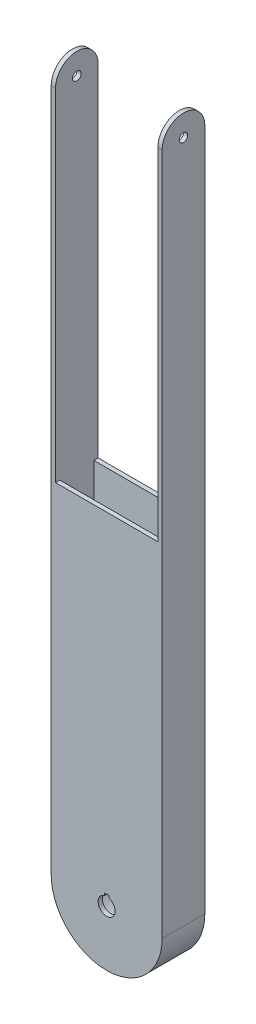
ISO-10303-21;
HEADER;
FILE_DESCRIPTION(('STEP AP214'),'2;1');
FILE_NAME('part.step','',(''),(''),'','','');
FILE_SCHEMA(('AUTOMOTIVE_DESIGN { 1 0 10303 214 1 1 1 1 }'));
ENDSEC;
DATA;
#1=APPLICATION_CONTEXT('core data for automotive mechanical design processes');
#2=APPLICATION_PROTOCOL_DEFINITION('international standard','automotive_design',2000,#1);
#3=PRODUCT_CONTEXT('',#1,'mechanical');
#4=PRODUCT('Part','Part','',(#3));
#5=PRODUCT_RELATED_PRODUCT_CATEGORY('part','',(#4));
#6=PRODUCT_DEFINITION_FORMATION('','',#4);
#7=PRODUCT_DEFINITION_CONTEXT('part definition',#1,'design');
#8=PRODUCT_DEFINITION('design','',#6,#7);
#9=PRODUCT_DEFINITION_SHAPE('','',#8);
#10=(LENGTH_UNIT() NAMED_UNIT(*) SI_UNIT(.MILLI.,.METRE.));
#11=(NAMED_UNIT(*) PLANE_ANGLE_UNIT() SI_UNIT($,.RADIAN.));
#12=(NAMED_UNIT(*) SI_UNIT($,.STERADIAN.) SOLID_ANGLE_UNIT());
#13=UNCERTAINTY_MEASURE_WITH_UNIT(LENGTH_MEASURE(1.E-05),#10,'distance_accuracy_value','');
#14=(GEOMETRIC_REPRESENTATION_CONTEXT(3) GLOBAL_UNCERTAINTY_ASSIGNED_CONTEXT((#13)) GLOBAL_UNIT_ASSIGNED_CONTEXT((#10,
#11,#12)) REPRESENTATION_CONTEXT('',''));
#15=CARTESIAN_POINT('',(0.,0.,0.));
#16=DIRECTION('',(0.,0.,1.));
#17=DIRECTION('',(1.,0.,0.));
#18=AXIS2_PLACEMENT_3D('',#15,#16,#17);
#19=CARTESIAN_POINT('',(-18.3612433862434,508.,0.));
#20=DIRECTION('',(1.,0.,0.));
#21=DIRECTION('',(0.,0.,-1.));
#22=AXIS2_PLACEMENT_3D('',#19,#20,#21);
#23=PLANE('',#22);
#24=CARTESIAN_POINT('',(-18.3612433862434,508.,-0.671957671957671));
#25=DIRECTION('',(-1.,0.,0.));
#26=DIRECTION('',(0.,0.,1.));
#27=AXIS2_PLACEMENT_3D('',#24,#25,#26);
#28=CIRCLE('',#27,3.175);
#29=CARTESIAN_POINT('',(-18.3612433862434,508.,2.50304232804233));
#30=VERTEX_POINT('',#29);
#31=EDGE_CURVE('E329',#30,#30,#28,.T.);
#32=ORIENTED_EDGE('',*,*,#31,.F.);
#33=EDGE_LOOP('',(#32));
#34=FACE_BOUND('',#33,.T.);
#35=DIRECTION('',(0.,0.,1.));
#36=VECTOR('',#35,1.);
#37=CARTESIAN_POINT('',(-18.3612433862434,0.,0.));
#38=LINE('',#37,#36);
#39=CARTESIAN_POINT('',(-18.3612433862434,0.,-16.5469576719577));
#40=VERTEX_POINT('',#39);
#41=CARTESIAN_POINT('',(-18.3612433862434,0.,15.2030423280423));
#42=VERTEX_POINT('',#41);
#43=EDGE_CURVE('E454',#40,#42,#38,.T.);
#44=ORIENTED_EDGE('',*,*,#43,.T.);
#45=DIRECTION('',(0.,-1.,0.));
#46=VECTOR('',#45,1.);
#47=CARTESIAN_POINT('',(-18.3612433862434,508.,15.2030423280423));
#48=LINE('',#47,#46);
#49=CARTESIAN_POINT('',(-18.3612433862434,508.,15.2030423280423));
#50=VERTEX_POINT('',#49);
#51=EDGE_CURVE('E576',#50,#42,#48,.T.);
#52=ORIENTED_EDGE('',*,*,#51,.F.);
#53=CARTESIAN_POINT('',(-18.3612433862434,508.,-0.671957671957671));
#54=DIRECTION('',(-1.,0.,0.));
#55=DIRECTION('',(0.,0.,1.));
#56=AXIS2_PLACEMENT_3D('',#53,#54,#55);
#57=CIRCLE('',#56,15.875);
#58=CARTESIAN_POINT('',(-18.3612433862434,508.,-16.5469576719577));
#59=VERTEX_POINT('',#58);
#60=EDGE_CURVE('E359',#50,#59,#57,.T.);
#61=ORIENTED_EDGE('',*,*,#60,.T.);
#62=DIRECTION('',(0.,-1.,0.));
#63=VECTOR('',#62,1.);
#64=CARTESIAN_POINT('',(-18.3612433862434,508.,-16.5469576719577));
#65=LINE('',#64,#63);
#66=EDGE_CURVE('E374',#59,#40,#65,.T.);
#67=ORIENTED_EDGE('',*,*,#66,.T.);
#68=EDGE_LOOP('',(#44,#52,#61,#67));
#69=FACE_BOUND('',#68,.T.);
#70=ADVANCED_FACE('F73',(#34,#69),#23,.F.);
#71=CARTESIAN_POINT('',(0.,508.,15.2030423280423));
#72=DIRECTION('',(0.,0.,-1.));
#73=DIRECTION('',(-1.,0.,0.));
#74=AXIS2_PLACEMENT_3D('',#71,#72,#73);
#75=PLANE('',#74);
#76=DIRECTION('',(1.,0.,0.));
#77=VECTOR('',#76,1.);
#78=CARTESIAN_POINT('',(25.5161774709475,508.,15.2030423280423));
#79=LINE('',#78,#77);
#80=CARTESIAN_POINT('',(61.0137566137566,508.,15.2030423280423));
#81=VERTEX_POINT('',#80);
#82=CARTESIAN_POINT('',(64.1887566137566,508.,15.2030423280423));
#83=VERTEX_POINT('',#82);
#84=EDGE_CURVE('E355',#81,#83,#79,.T.);
#85=ORIENTED_EDGE('',*,*,#84,.F.);
#86=DIRECTION('',(0.,1.,0.));
#87=VECTOR('',#86,1.);
#88=CARTESIAN_POINT('',(61.0137566137566,508.,15.2030423280423));
#89=LINE('',#88,#87);
#90=CARTESIAN_POINT('',(61.0137566137566,254.,15.2030423280423));
#91=VERTEX_POINT('',#90);
#92=EDGE_CURVE('E325',#91,#81,#89,.T.);
#93=ORIENTED_EDGE('',*,*,#92,.F.);
#94=DIRECTION('',(1.,0.,0.));
#95=VECTOR('',#94,1.);
#96=CARTESIAN_POINT('',(-15.1862433862434,254.,15.2030423280423));
#97=LINE('',#96,#95);
#98=CARTESIAN_POINT('',(-15.1862433862434,254.,15.2030423280423));
#99=VERTEX_POINT('',#98);
#100=EDGE_CURVE('E321',#99,#91,#97,.T.);
#101=ORIENTED_EDGE('',*,*,#100,.F.);
#102=DIRECTION('',(0.,-1.,0.));
#103=VECTOR('',#102,1.);
#104=CARTESIAN_POINT('',(-15.1862433862434,508.,15.2030423280423));
#105=LINE('',#104,#103);
#106=CARTESIAN_POINT('',(-15.1862433862434,508.,15.2030423280423));
#107=VERTEX_POINT('',#106);
#108=EDGE_CURVE('E314',#107,#99,#105,.T.);
#109=ORIENTED_EDGE('',*,*,#108,.F.);
#110=DIRECTION('',(1.,0.,0.));
#111=VECTOR('',#110,1.);
#112=CARTESIAN_POINT('',(0.,508.,15.2030423280423));
#113=LINE('',#112,#111);
#114=EDGE_CURVE('E444',#50,#107,#113,.T.);
#115=ORIENTED_EDGE('',*,*,#114,.F.);
#116=ORIENTED_EDGE('',*,*,#51,.T.);
#117=CARTESIAN_POINT('',(22.9137566137566,0.,15.2030423280423));
#118=DIRECTION('',(0.,0.,-1.));
#119=DIRECTION('',(-1.,0.,0.));
#120=AXIS2_PLACEMENT_3D('',#117,#118,#119);
#121=CIRCLE('',#120,41.275);
#122=CARTESIAN_POINT('',(64.1887566137566,0.,15.2030423280423));
#123=VERTEX_POINT('',#122);
#124=EDGE_CURVE('E473',#42,#123,#121,.F.);
#125=ORIENTED_EDGE('',*,*,#124,.T.);
#126=DIRECTION('',(0.,-1.,0.));
#127=VECTOR('',#126,1.);
#128=CARTESIAN_POINT('',(64.1887566137566,508.,15.2030423280423));
#129=LINE('',#128,#127);
#130=EDGE_CURVE('E388',#83,#123,#129,.T.);
#131=ORIENTED_EDGE('',*,*,#130,.F.);
#132=EDGE_LOOP('',(#85,#93,#101,#109,#115,#116,#125,#131));
#133=FACE_BOUND('',#132,.T.);
#134=DIRECTION('',(-1.,0.,0.));
#135=VECTOR('',#134,1.);
#136=CARTESIAN_POINT('',(21.3262566137566,7.9375,15.2030423280423));
#137=LINE('',#136,#135);
#138=CARTESIAN_POINT('',(24.5012566137566,7.9375,15.2030423280423));
#139=VERTEX_POINT('',#138);
#140=CARTESIAN_POINT('',(21.3262566137566,7.9375,15.2030423280423));
#141=VERTEX_POINT('',#140);
#142=EDGE_CURVE('E438',#139,#141,#137,.T.);
#143=ORIENTED_EDGE('',*,*,#142,.F.);
#144=DIRECTION('',(0.,1.,0.));
#145=VECTOR('',#144,1.);
#146=CARTESIAN_POINT('',(24.5012566137566,0.,15.2030423280423));
#147=LINE('',#146,#145);
#148=CARTESIAN_POINT('',(24.5012566137566,6.14836106210428,15.2030423280423));
#149=VERTEX_POINT('',#148);
#150=EDGE_CURVE('E433',#149,#139,#147,.T.);
#151=ORIENTED_EDGE('',*,*,#150,.F.);
#152=CARTESIAN_POINT('',(22.9137566137566,0.,15.2030423280423));
#153=DIRECTION('',(0.,0.,-1.));
#154=DIRECTION('',(-1.,0.,0.));
#155=AXIS2_PLACEMENT_3D('',#152,#153,#154);
#156=CIRCLE('',#155,6.35);
#157=CARTESIAN_POINT('',(21.3262566137566,6.14836106210428,15.2030423280423));
#158=VERTEX_POINT('',#157);
#159=EDGE_CURVE('E608',#158,#149,#156,.F.);
#160=ORIENTED_EDGE('',*,*,#159,.F.);
#161=DIRECTION('',(0.,-1.,0.));
#162=VECTOR('',#161,1.);
#163=CARTESIAN_POINT('',(21.3262566137566,0.,15.2030423280423));
#164=LINE('',#163,#162);
#165=EDGE_CURVE('E413',#141,#158,#164,.T.);
#166=ORIENTED_EDGE('',*,*,#165,.F.);
#167=EDGE_LOOP('',(#143,#151,#160,#166));
#168=FACE_BOUND('',#167,.T.);
#169=ADVANCED_FACE('F561',(#133,#168),#75,.F.);
#170=CARTESIAN_POINT('',(64.1887566137566,508.,0.));
#171=DIRECTION('',(-1.,0.,0.));
#172=DIRECTION('',(0.,0.,1.));
#173=AXIS2_PLACEMENT_3D('',#170,#171,#172);
#174=PLANE('',#173);
#175=CARTESIAN_POINT('',(64.1887566137566,508.,-0.671957671957671));
#176=DIRECTION('',(-1.,0.,0.));
#177=DIRECTION('',(0.,0.,1.));
#178=AXIS2_PLACEMENT_3D('',#175,#176,#177);
#179=CIRCLE('',#178,3.175);
#180=CARTESIAN_POINT('',(64.1887566137566,508.,2.50304232804233));
#181=VERTEX_POINT('',#180);
#182=EDGE_CURVE('E334',#181,#181,#179,.F.);
#183=ORIENTED_EDGE('',*,*,#182,.F.);
#184=EDGE_LOOP('',(#183));
#185=FACE_BOUND('',#184,.T.);
#186=DIRECTION('',(0.,0.,-1.));
#187=VECTOR('',#186,1.);
#188=CARTESIAN_POINT('',(64.1887566137566,0.,0.));
#189=LINE('',#188,#187);
#190=CARTESIAN_POINT('',(64.1887566137566,0.,-16.5469576719577));
#191=VERTEX_POINT('',#190);
#192=EDGE_CURVE('E381',#123,#191,#189,.T.);
#193=ORIENTED_EDGE('',*,*,#192,.T.);
#194=DIRECTION('',(0.,-1.,0.));
#195=VECTOR('',#194,1.);
#196=CARTESIAN_POINT('',(64.1887566137566,508.,-16.5469576719577));
#197=LINE('',#196,#195);
#198=CARTESIAN_POINT('',(64.1887566137566,508.,-16.5469576719577));
#199=VERTEX_POINT('',#198);
#200=EDGE_CURVE('E379',#199,#191,#197,.T.);
#201=ORIENTED_EDGE('',*,*,#200,.F.);
#202=CARTESIAN_POINT('',(64.1887566137566,508.,-0.671957671957671));
#203=DIRECTION('',(1.,0.,0.));
#204=DIRECTION('',(0.,0.,-1.));
#205=AXIS2_PLACEMENT_3D('',#202,#203,#204);
#206=CIRCLE('',#205,15.875);
#207=EDGE_CURVE('E345',#199,#83,#206,.T.);
#208=ORIENTED_EDGE('',*,*,#207,.T.);
#209=ORIENTED_EDGE('',*,*,#130,.T.);
#210=EDGE_LOOP('',(#193,#201,#208,#209));
#211=FACE_BOUND('',#210,.T.);
#212=ADVANCED_FACE('F558',(#185,#211),#174,.F.);
#213=CARTESIAN_POINT('',(0.,508.,-16.5469576719577));
#214=DIRECTION('',(0.,0.,1.));
#215=DIRECTION('',(1.,0.,0.));
#216=AXIS2_PLACEMENT_3D('',#213,#214,#215);
#217=PLANE('',#216);
#218=CARTESIAN_POINT('',(22.9137566137566,0.,-16.5469576719577));
#219=DIRECTION('',(0.,0.,-1.));
#220=DIRECTION('',(-1.,0.,0.));
#221=AXIS2_PLACEMENT_3D('',#218,#219,#220);
#222=CIRCLE('',#221,6.35);
#223=CARTESIAN_POINT('',(24.5012566137566,6.14836106210428,-16.5469576719577));
#224=VERTEX_POINT('',#223);
#225=CARTESIAN_POINT('',(21.3262566137566,6.14836106210428,-16.5469576719577));
#226=VERTEX_POINT('',#225);
#227=EDGE_CURVE('E532',#224,#226,#222,.T.);
#228=ORIENTED_EDGE('',*,*,#227,.F.);
#229=DIRECTION('',(0.,-1.,0.));
#230=VECTOR('',#229,1.);
#231=CARTESIAN_POINT('',(24.5012566137566,0.,-16.5469576719577));
#232=LINE('',#231,#230);
#233=CARTESIAN_POINT('',(24.5012566137566,7.9375,-16.5469576719577));
#234=VERTEX_POINT('',#233);
#235=EDGE_CURVE('E428',#234,#224,#232,.T.);
#236=ORIENTED_EDGE('',*,*,#235,.F.);
#237=DIRECTION('',(1.,0.,0.));
#238=VECTOR('',#237,1.);
#239=CARTESIAN_POINT('',(21.3262566137566,7.9375,-16.5469576719577));
#240=LINE('',#239,#238);
#241=CARTESIAN_POINT('',(21.3262566137566,7.9375,-16.5469576719577));
#242=VERTEX_POINT('',#241);
#243=EDGE_CURVE('E398',#242,#234,#240,.T.);
#244=ORIENTED_EDGE('',*,*,#243,.F.);
#245=DIRECTION('',(0.,1.,0.));
#246=VECTOR('',#245,1.);
#247=CARTESIAN_POINT('',(21.3262566137566,0.,-16.5469576719577));
#248=LINE('',#247,#246);
#249=EDGE_CURVE('E405',#226,#242,#248,.T.);
#250=ORIENTED_EDGE('',*,*,#249,.F.);
#251=EDGE_LOOP('',(#228,#236,#244,#250));
#252=FACE_BOUND('',#251,.T.);
#253=DIRECTION('',(-1.,0.,0.));
#254=VECTOR('',#253,1.);
#255=CARTESIAN_POINT('',(-15.1862433862434,254.,-16.5469576719577));
#256=LINE('',#255,#254);
#257=CARTESIAN_POINT('',(61.0137566137566,254.,-16.5469576719577));
#258=VERTEX_POINT('',#257);
#259=CARTESIAN_POINT('',(-15.1862433862434,254.,-16.5469576719577));
#260=VERTEX_POINT('',#259);
#261=EDGE_CURVE('E270',#258,#260,#256,.T.);
#262=ORIENTED_EDGE('',*,*,#261,.F.);
#263=DIRECTION('',(0.,-1.,0.));
#264=VECTOR('',#263,1.);
#265=CARTESIAN_POINT('',(61.0137566137566,508.,-16.5469576719577));
#266=LINE('',#265,#264);
#267=CARTESIAN_POINT('',(61.0137566137566,508.,-16.5469576719577));
#268=VERTEX_POINT('',#267);
#269=EDGE_CURVE('E279',#268,#258,#266,.T.);
#270=ORIENTED_EDGE('',*,*,#269,.F.);
#271=DIRECTION('',(-1.,0.,0.));
#272=VECTOR('',#271,1.);
#273=CARTESIAN_POINT('',(0.,508.,-16.5469576719577));
#274=LINE('',#273,#272);
#275=EDGE_CURVE('E380',#199,#268,#274,.T.);
#276=ORIENTED_EDGE('',*,*,#275,.F.);
#277=ORIENTED_EDGE('',*,*,#200,.T.);
#278=CARTESIAN_POINT('',(22.9137566137566,0.,-16.5469576719577));
#279=DIRECTION('',(0.,0.,-1.));
#280=DIRECTION('',(-1.,0.,0.));
#281=AXIS2_PLACEMENT_3D('',#278,#279,#280);
#282=CIRCLE('',#281,41.275);
#283=EDGE_CURVE('E465',#191,#40,#282,.T.);
#284=ORIENTED_EDGE('',*,*,#283,.T.);
#285=ORIENTED_EDGE('',*,*,#66,.F.);
#286=DIRECTION('',(-1.,0.,0.));
#287=VECTOR('',#286,1.);
#288=CARTESIAN_POINT('',(20.3113357565658,508.,-16.5469576719577));
#289=LINE('',#288,#287);
#290=CARTESIAN_POINT('',(-15.1862433862434,508.,-16.5469576719577));
#291=VERTEX_POINT('',#290);
#292=EDGE_CURVE('E432',#291,#59,#289,.T.);
#293=ORIENTED_EDGE('',*,*,#292,.F.);
#294=DIRECTION('',(0.,1.,0.));
#295=VECTOR('',#294,1.);
#296=CARTESIAN_POINT('',(-15.1862433862434,508.,-16.5469576719577));
#297=LINE('',#296,#295);
#298=EDGE_CURVE('E276',#260,#291,#297,.T.);
#299=ORIENTED_EDGE('',*,*,#298,.F.);
#300=EDGE_LOOP('',(#262,#270,#276,#277,#284,#285,#293,#299));
#301=FACE_BOUND('',#300,.T.);
#302=ADVANCED_FACE('F290',(#252,#301),#217,.F.);
#303=CARTESIAN_POINT('',(-15.1862433862434,508.,12.0280423280423));
#304=DIRECTION('',(1.,0.,0.));
#305=DIRECTION('',(0.,0.,-1.));
#306=AXIS2_PLACEMENT_3D('',#303,#304,#305);
#307=PLANE('',#306);
#308=CARTESIAN_POINT('',(-15.1862433862434,508.,-0.671957671957671));
#309=DIRECTION('',(1.,0.,0.));
#310=DIRECTION('',(0.,0.,-1.));
#311=AXIS2_PLACEMENT_3D('',#308,#309,#310);
#312=CIRCLE('',#311,3.175);
#313=CARTESIAN_POINT('',(-15.1862433862434,508.,-3.84695767195767));
#314=VERTEX_POINT('',#313);
#315=EDGE_CURVE('E340',#314,#314,#312,.T.);
#316=ORIENTED_EDGE('',*,*,#315,.F.);
#317=EDGE_LOOP('',(#316));
#318=FACE_BOUND('',#317,.T.);
#319=DIRECTION('',(0.,-1.,0.));
#320=VECTOR('',#319,1.);
#321=CARTESIAN_POINT('',(-15.1862433862434,508.,-13.3719576719577));
#322=LINE('',#321,#320);
#323=CARTESIAN_POINT('',(-15.1862433862434,254.,-13.3719576719577));
#324=VERTEX_POINT('',#323);
#325=CARTESIAN_POINT('',(-15.1862433862434,0.,-13.3719576719577));
#326=VERTEX_POINT('',#325);
#327=EDGE_CURVE('E510',#324,#326,#322,.T.);
#328=ORIENTED_EDGE('',*,*,#327,.F.);
#329=DIRECTION('',(0.,0.,-1.));
#330=VECTOR('',#329,1.);
#331=CARTESIAN_POINT('',(-15.1862433862434,254.,280.38682765437));
#332=LINE('',#331,#330);
#333=EDGE_CURVE('E92',#324,#260,#332,.T.);
#334=ORIENTED_EDGE('',*,*,#333,.T.);
#335=ORIENTED_EDGE('',*,*,#298,.T.);
#336=CARTESIAN_POINT('',(-15.1862433862434,508.,-0.671957671957671));
#337=DIRECTION('',(1.,0.,0.));
#338=DIRECTION('',(0.,0.,-1.));
#339=AXIS2_PLACEMENT_3D('',#336,#337,#338);
#340=CIRCLE('',#339,15.875);
#341=EDGE_CURVE('E364',#107,#291,#340,.F.);
#342=ORIENTED_EDGE('',*,*,#341,.F.);
#343=ORIENTED_EDGE('',*,*,#108,.T.);
#344=CARTESIAN_POINT('',(-15.1862433862434,254.,12.0280423280423));
#345=VERTEX_POINT('',#344);
#346=EDGE_CURVE('E310',#99,#345,#332,.T.);
#347=ORIENTED_EDGE('',*,*,#346,.T.);
#348=DIRECTION('',(0.,-1.,0.));
#349=VECTOR('',#348,1.);
#350=CARTESIAN_POINT('',(-15.1862433862434,508.,12.0280423280423));
#351=LINE('',#350,#349);
#352=CARTESIAN_POINT('',(-15.1862433862434,0.,12.0280423280423));
#353=VERTEX_POINT('',#352);
#354=EDGE_CURVE('E449',#345,#353,#351,.T.);
#355=ORIENTED_EDGE('',*,*,#354,.T.);
#356=DIRECTION('',(0.,0.,1.));
#357=VECTOR('',#356,1.);
#358=CARTESIAN_POINT('',(-15.1862433862434,0.,12.0280423280423));
#359=LINE('',#358,#357);
#360=EDGE_CURVE('E489',#326,#353,#359,.T.);
#361=ORIENTED_EDGE('',*,*,#360,.F.);
#362=EDGE_LOOP('',(#328,#334,#335,#342,#343,#347,#355,#361));
#363=FACE_BOUND('',#362,.T.);
#364=ADVANCED_FACE('F741',(#318,#363),#307,.T.);
#365=CARTESIAN_POINT('',(-15.1862433862434,508.,12.0280423280423));
#366=DIRECTION('',(0.,0.,-1.));
#367=DIRECTION('',(-1.,0.,0.));
#368=AXIS2_PLACEMENT_3D('',#365,#366,#367);
#369=PLANE('',#368);
#370=DIRECTION('',(-1.,0.,0.));
#371=VECTOR('',#370,1.);
#372=CARTESIAN_POINT('',(-15.1862433862434,254.,12.0280423280423));
#373=LINE('',#372,#371);
#374=CARTESIAN_POINT('',(61.0137566137566,254.,12.0280423280423));
#375=VERTEX_POINT('',#374);
#376=EDGE_CURVE('E324',#375,#345,#373,.T.);
#377=ORIENTED_EDGE('',*,*,#376,.F.);
#378=DIRECTION('',(0.,-1.,0.));
#379=VECTOR('',#378,1.);
#380=CARTESIAN_POINT('',(61.0137566137566,508.,12.0280423280423));
#381=LINE('',#380,#379);
#382=CARTESIAN_POINT('',(61.0137566137566,0.,12.0280423280423));
#383=VERTEX_POINT('',#382);
#384=EDGE_CURVE('E502',#375,#383,#381,.T.);
#385=ORIENTED_EDGE('',*,*,#384,.T.);
#386=DIRECTION('',(1.,0.,0.));
#387=VECTOR('',#386,1.);
#388=CARTESIAN_POINT('',(-15.1862433862434,0.,12.0280423280423));
#389=LINE('',#388,#387);
#390=CARTESIAN_POINT('',(48.3137566137566,0.,12.0280423280423));
#391=VERTEX_POINT('',#390);
#392=EDGE_CURVE('E484',#391,#383,#389,.T.);
#393=ORIENTED_EDGE('',*,*,#392,.F.);
#394=CARTESIAN_POINT('',(22.9137566137566,0.,12.0280423280423));
#395=DIRECTION('',(0.,0.,-1.));
#396=DIRECTION('',(-1.,0.,0.));
#397=AXIS2_PLACEMENT_3D('',#394,#395,#396);
#398=CIRCLE('',#397,25.4);
#399=CARTESIAN_POINT('',(-2.48624338624338,0.,12.0280423280423));
#400=VERTEX_POINT('',#399);
#401=EDGE_CURVE('E622',#400,#391,#398,.F.);
#402=ORIENTED_EDGE('',*,*,#401,.F.);
#403=DIRECTION('',(1.,0.,0.));
#404=VECTOR('',#403,1.);
#405=CARTESIAN_POINT('',(-15.1862433862434,0.,12.0280423280423));
#406=LINE('',#405,#404);
#407=EDGE_CURVE('E494',#353,#400,#406,.T.);
#408=ORIENTED_EDGE('',*,*,#407,.F.);
#409=ORIENTED_EDGE('',*,*,#354,.F.);
#410=EDGE_LOOP('',(#377,#385,#393,#402,#408,#409));
#411=FACE_BOUND('',#410,.T.);
#412=DIRECTION('',(0.,-1.,0.));
#413=VECTOR('',#412,1.);
#414=CARTESIAN_POINT('',(24.5012566137566,508.,12.0280423280423));
#415=LINE('',#414,#413);
#416=CARTESIAN_POINT('',(24.5012566137566,7.9375,12.0280423280423));
#417=VERTEX_POINT('',#416);
#418=CARTESIAN_POINT('',(24.5012566137566,6.14836106210428,12.0280423280423));
#419=VERTEX_POINT('',#418);
#420=EDGE_CURVE('E696',#417,#419,#415,.T.);
#421=ORIENTED_EDGE('',*,*,#420,.F.);
#422=DIRECTION('',(1.,0.,0.));
#423=VECTOR('',#422,1.);
#424=CARTESIAN_POINT('',(-15.1862433862434,7.93750000000004,12.0280423280423));
#425=LINE('',#424,#423);
#426=CARTESIAN_POINT('',(21.3262566137566,7.9375,12.0280423280423));
#427=VERTEX_POINT('',#426);
#428=EDGE_CURVE('E525',#427,#417,#425,.T.);
#429=ORIENTED_EDGE('',*,*,#428,.F.);
#430=DIRECTION('',(0.,1.,0.));
#431=VECTOR('',#430,1.);
#432=CARTESIAN_POINT('',(21.3262566137566,508.,12.0280423280423));
#433=LINE('',#432,#431);
#434=CARTESIAN_POINT('',(21.3262566137566,6.14836106210428,12.0280423280423));
#435=VERTEX_POINT('',#434);
#436=EDGE_CURVE('E437',#435,#427,#433,.T.);
#437=ORIENTED_EDGE('',*,*,#436,.F.);
#438=CARTESIAN_POINT('',(22.9137566137566,0.,12.0280423280423));
#439=DIRECTION('',(0.,0.,-1.));
#440=DIRECTION('',(-1.,0.,0.));
#441=AXIS2_PLACEMENT_3D('',#438,#439,#440);
#442=CIRCLE('',#441,6.35);
#443=EDGE_CURVE('E615',#419,#435,#442,.T.);
#444=ORIENTED_EDGE('',*,*,#443,.F.);
#445=EDGE_LOOP('',(#421,#429,#437,#444));
#446=FACE_BOUND('',#445,.T.);
#447=ADVANCED_FACE('F734',(#411,#446),#369,.T.);
#448=CARTESIAN_POINT('',(61.0137566137566,508.,12.0280423280423));
#449=DIRECTION('',(-1.,0.,0.));
#450=DIRECTION('',(0.,0.,1.));
#451=AXIS2_PLACEMENT_3D('',#448,#449,#450);
#452=PLANE('',#451);
#453=ORIENTED_EDGE('',*,*,#384,.F.);
#454=DIRECTION('',(0.,0.,-1.));
#455=VECTOR('',#454,1.);
#456=CARTESIAN_POINT('',(61.0137566137566,254.,280.38682765437));
#457=LINE('',#456,#455);
#458=EDGE_CURVE('E275',#91,#375,#457,.T.);
#459=ORIENTED_EDGE('',*,*,#458,.F.);
#460=ORIENTED_EDGE('',*,*,#92,.T.);
#461=CARTESIAN_POINT('',(61.0137566137566,508.,-0.671957671957671));
#462=DIRECTION('',(-1.,0.,0.));
#463=DIRECTION('',(0.,0.,1.));
#464=AXIS2_PLACEMENT_3D('',#461,#462,#463);
#465=CIRCLE('',#464,15.875);
#466=EDGE_CURVE('E284',#268,#81,#465,.F.);
#467=ORIENTED_EDGE('',*,*,#466,.F.);
#468=ORIENTED_EDGE('',*,*,#269,.T.);
#469=CARTESIAN_POINT('',(61.0137566137566,254.,-13.3719576719576));
#470=VERTEX_POINT('',#469);
#471=EDGE_CURVE('E266',#470,#258,#457,.T.);
#472=ORIENTED_EDGE('',*,*,#471,.F.);
#473=DIRECTION('',(0.,-1.,0.));
#474=VECTOR('',#473,1.);
#475=CARTESIAN_POINT('',(61.0137566137566,508.,-13.3719576719577));
#476=LINE('',#475,#474);
#477=CARTESIAN_POINT('',(61.0137566137566,0.,-13.3719576719577));
#478=VERTEX_POINT('',#477);
#479=EDGE_CURVE('E506',#470,#478,#476,.T.);
#480=ORIENTED_EDGE('',*,*,#479,.T.);
#481=DIRECTION('',(0.,0.,-1.));
#482=VECTOR('',#481,1.);
#483=CARTESIAN_POINT('',(61.0137566137566,0.,12.0280423280423));
#484=LINE('',#483,#482);
#485=EDGE_CURVE('E646',#383,#478,#484,.T.);
#486=ORIENTED_EDGE('',*,*,#485,.F.);
#487=EDGE_LOOP('',(#453,#459,#460,#467,#468,#472,#480,#486));
#488=FACE_BOUND('',#487,.T.);
#489=CARTESIAN_POINT('',(61.0137566137566,508.,-0.671957671957671));
#490=DIRECTION('',(-1.,0.,0.));
#491=DIRECTION('',(0.,0.,1.));
#492=AXIS2_PLACEMENT_3D('',#489,#490,#491);
#493=CIRCLE('',#492,3.175);
#494=CARTESIAN_POINT('',(61.0137566137566,508.,2.50304232804233));
#495=VERTEX_POINT('',#494);
#496=EDGE_CURVE('E346',#495,#495,#493,.T.);
#497=ORIENTED_EDGE('',*,*,#496,.F.);
#498=EDGE_LOOP('',(#497));
#499=FACE_BOUND('',#498,.T.);
#500=ADVANCED_FACE('F281',(#488,#499),#452,.T.);
#501=CARTESIAN_POINT('',(-15.1862433862434,508.,-13.3719576719577));
#502=DIRECTION('',(0.,0.,1.));
#503=DIRECTION('',(1.,0.,0.));
#504=AXIS2_PLACEMENT_3D('',#501,#502,#503);
#505=PLANE('',#504);
#506=DIRECTION('',(1.,0.,0.));
#507=VECTOR('',#506,1.);
#508=CARTESIAN_POINT('',(-15.1862433862434,254.,-13.3719576719577));
#509=LINE('',#508,#507);
#510=EDGE_CURVE('E13',#324,#470,#509,.T.);
#511=ORIENTED_EDGE('',*,*,#510,.F.);
#512=ORIENTED_EDGE('',*,*,#327,.T.);
#513=DIRECTION('',(-1.,0.,0.));
#514=VECTOR('',#513,1.);
#515=CARTESIAN_POINT('',(-15.1862433862434,0.,-13.3719576719577));
#516=LINE('',#515,#514);
#517=CARTESIAN_POINT('',(-2.48624338624339,0.,-13.3719576719577));
#518=VERTEX_POINT('',#517);
#519=EDGE_CURVE('E639',#518,#326,#516,.T.);
#520=ORIENTED_EDGE('',*,*,#519,.F.);
#521=CARTESIAN_POINT('',(22.9137566137566,0.,-13.3719576719577));
#522=DIRECTION('',(0.,0.,1.));
#523=DIRECTION('',(1.,0.,0.));
#524=AXIS2_PLACEMENT_3D('',#521,#522,#523);
#525=CIRCLE('',#524,25.4);
#526=CARTESIAN_POINT('',(48.3137566137566,0.,-13.3719576719577));
#527=VERTEX_POINT('',#526);
#528=EDGE_CURVE('E472',#527,#518,#525,.F.);
#529=ORIENTED_EDGE('',*,*,#528,.F.);
#530=EDGE_CURVE('E645',#478,#527,#516,.T.);
#531=ORIENTED_EDGE('',*,*,#530,.F.);
#532=ORIENTED_EDGE('',*,*,#479,.F.);
#533=EDGE_LOOP('',(#511,#512,#520,#529,#531,#532));
#534=FACE_BOUND('',#533,.T.);
#535=DIRECTION('',(0.,1.,0.));
#536=VECTOR('',#535,1.);
#537=CARTESIAN_POINT('',(24.5012566137566,508.,-13.3719576719577));
#538=LINE('',#537,#536);
#539=CARTESIAN_POINT('',(24.5012566137566,6.14836106210428,-13.3719576719577));
#540=VERTEX_POINT('',#539);
#541=CARTESIAN_POINT('',(24.5012566137566,7.9375,-13.3719576719577));
#542=VERTEX_POINT('',#541);
#543=EDGE_CURVE('E521',#540,#542,#538,.T.);
#544=ORIENTED_EDGE('',*,*,#543,.F.);
#545=CARTESIAN_POINT('',(22.9137566137566,0.,-13.3719576719577));
#546=DIRECTION('',(0.,0.,1.));
#547=DIRECTION('',(1.,0.,0.));
#548=AXIS2_PLACEMENT_3D('',#545,#546,#547);
#549=CIRCLE('',#548,6.35);
#550=CARTESIAN_POINT('',(21.3262566137566,6.14836106210428,-13.3719576719577));
#551=VERTEX_POINT('',#550);
#552=EDGE_CURVE('E611',#551,#540,#549,.T.);
#553=ORIENTED_EDGE('',*,*,#552,.F.);
#554=DIRECTION('',(0.,-1.,0.));
#555=VECTOR('',#554,1.);
#556=CARTESIAN_POINT('',(21.3262566137566,508.,-13.3719576719577));
#557=LINE('',#556,#555);
#558=CARTESIAN_POINT('',(21.3262566137566,7.9375,-13.3719576719577));
#559=VERTEX_POINT('',#558);
#560=EDGE_CURVE('E103',#559,#551,#557,.T.);
#561=ORIENTED_EDGE('',*,*,#560,.F.);
#562=DIRECTION('',(-1.,0.,0.));
#563=VECTOR('',#562,1.);
#564=CARTESIAN_POINT('',(-15.1862433862434,7.93750000000004,-13.3719576719577));
#565=LINE('',#564,#563);
#566=EDGE_CURVE('E83',#542,#559,#565,.T.);
#567=ORIENTED_EDGE('',*,*,#566,.F.);
#568=EDGE_LOOP('',(#544,#553,#561,#567));
#569=FACE_BOUND('',#568,.T.);
#570=ADVANCED_FACE('F640',(#534,#569),#505,.T.);
#571=CARTESIAN_POINT('',(22.9137566137566,0.,107.496748099346));
#572=DIRECTION('',(0.,0.,-1.));
#573=DIRECTION('',(-1.,0.,0.));
#574=AXIS2_PLACEMENT_3D('',#571,#572,#573);
#575=CYLINDRICAL_SURFACE('',#574,41.275);
#576=ORIENTED_EDGE('',*,*,#124,.F.);
#577=ORIENTED_EDGE('',*,*,#43,.F.);
#578=ORIENTED_EDGE('',*,*,#283,.F.);
#579=ORIENTED_EDGE('',*,*,#192,.F.);
#580=EDGE_LOOP('',(#576,#577,#578,#579));
#581=FACE_BOUND('',#580,.T.);
#582=ADVANCED_FACE('F573',(#581),#575,.T.);
#583=CARTESIAN_POINT('',(64.1887566137566,0.,107.496748099346));
#584=DIRECTION('',(0.,1.,0.));
#585=DIRECTION('',(0.,0.,1.));
#586=AXIS2_PLACEMENT_3D('',#583,#584,#585);
#587=PLANE('',#586);
#588=DIRECTION('',(0.,0.,-1.));
#589=VECTOR('',#588,1.);
#590=CARTESIAN_POINT('',(48.3137566137566,0.,107.496748099346));
#591=LINE('',#590,#589);
#592=EDGE_CURVE('E475',#391,#527,#591,.T.);
#593=ORIENTED_EDGE('',*,*,#592,.F.);
#594=ORIENTED_EDGE('',*,*,#392,.T.);
#595=ORIENTED_EDGE('',*,*,#485,.T.);
#596=ORIENTED_EDGE('',*,*,#530,.T.);
#597=EDGE_LOOP('',(#593,#594,#595,#596));
#598=FACE_BOUND('',#597,.T.);
#599=ADVANCED_FACE('F739',(#598),#587,.T.);
#600=CARTESIAN_POINT('',(22.9137566137566,0.,107.496748099346));
#601=DIRECTION('',(0.,0.,-1.));
#602=DIRECTION('',(-1.,0.,0.));
#603=AXIS2_PLACEMENT_3D('',#600,#601,#602);
#604=CYLINDRICAL_SURFACE('',#603,25.4);
#605=ORIENTED_EDGE('',*,*,#401,.T.);
#606=ORIENTED_EDGE('',*,*,#592,.T.);
#607=ORIENTED_EDGE('',*,*,#528,.T.);
#608=DIRECTION('',(0.,0.,-1.));
#609=VECTOR('',#608,1.);
#610=CARTESIAN_POINT('',(-2.48624338624338,0.,107.496748099346));
#611=LINE('',#610,#609);
#612=EDGE_CURVE('E471',#400,#518,#611,.T.);
#613=ORIENTED_EDGE('',*,*,#612,.F.);
#614=EDGE_LOOP('',(#605,#606,#607,#613));
#615=FACE_BOUND('',#614,.T.);
#616=ADVANCED_FACE('F631',(#615),#604,.F.);
#617=CARTESIAN_POINT('',(-2.48624338624338,0.,107.496748099346));
#618=DIRECTION('',(0.,1.,0.));
#619=DIRECTION('',(0.,0.,1.));
#620=AXIS2_PLACEMENT_3D('',#617,#618,#619);
#621=PLANE('',#620);
#622=ORIENTED_EDGE('',*,*,#360,.T.);
#623=ORIENTED_EDGE('',*,*,#407,.T.);
#624=ORIENTED_EDGE('',*,*,#612,.T.);
#625=ORIENTED_EDGE('',*,*,#519,.T.);
#626=EDGE_LOOP('',(#622,#623,#624,#625));
#627=FACE_BOUND('',#626,.T.);
#628=ADVANCED_FACE('F647',(#627),#621,.T.);
#629=CARTESIAN_POINT('',(22.9137566137566,0.,33.1635545701807));
#630=DIRECTION('',(0.,0.,-1.));
#631=DIRECTION('',(-1.,0.,0.));
#632=AXIS2_PLACEMENT_3D('',#629,#630,#631);
#633=CYLINDRICAL_SURFACE('',#632,6.35);
#634=ORIENTED_EDGE('',*,*,#552,.T.);
#635=DIRECTION('',(0.,0.,-1.));
#636=VECTOR('',#635,1.);
#637=CARTESIAN_POINT('',(24.5012566137566,6.14836106210428,33.1635545701807));
#638=LINE('',#637,#636);
#639=EDGE_CURVE('E526',#540,#224,#638,.T.);
#640=ORIENTED_EDGE('',*,*,#639,.T.);
#641=ORIENTED_EDGE('',*,*,#227,.T.);
#642=DIRECTION('',(0.,0.,-1.));
#643=VECTOR('',#642,1.);
#644=CARTESIAN_POINT('',(21.3262566137566,6.14836106210428,33.1635545701807));
#645=LINE('',#644,#643);
#646=EDGE_CURVE('E697',#226,#551,#645,.F.);
#647=ORIENTED_EDGE('',*,*,#646,.T.);
#648=EDGE_LOOP('',(#634,#640,#641,#647));
#649=FACE_BOUND('',#648,.T.);
#650=ADVANCED_FACE('F792',(#649),#633,.F.);
#651=ORIENTED_EDGE('',*,*,#159,.T.);
#652=DIRECTION('',(0.,0.,-1.));
#653=VECTOR('',#652,1.);
#654=CARTESIAN_POINT('',(24.5012566137566,6.14836106210428,33.1635545701807));
#655=LINE('',#654,#653);
#656=EDGE_CURVE('E541',#149,#419,#655,.T.);
#657=ORIENTED_EDGE('',*,*,#656,.T.);
#658=ORIENTED_EDGE('',*,*,#443,.T.);
#659=DIRECTION('',(0.,0.,-1.));
#660=VECTOR('',#659,1.);
#661=CARTESIAN_POINT('',(21.3262566137566,6.14836106210428,33.1635545701807));
#662=LINE('',#661,#660);
#663=EDGE_CURVE('E684',#435,#158,#662,.F.);
#664=ORIENTED_EDGE('',*,*,#663,.T.);
#665=EDGE_LOOP('',(#651,#657,#658,#664));
#666=FACE_BOUND('',#665,.T.);
#667=ADVANCED_FACE('F810',(#666),#633,.F.);
#668=CARTESIAN_POINT('',(24.5012566137566,0.,23.7519914593684));
#669=DIRECTION('',(1.,0.,0.));
#670=DIRECTION('',(0.,0.,-1.));
#671=AXIS2_PLACEMENT_3D('',#668,#669,#670);
#672=PLANE('',#671);
#673=ORIENTED_EDGE('',*,*,#420,.T.);
#674=ORIENTED_EDGE('',*,*,#656,.F.);
#675=ORIENTED_EDGE('',*,*,#150,.T.);
#676=DIRECTION('',(0.,0.,-1.));
#677=VECTOR('',#676,1.);
#678=CARTESIAN_POINT('',(24.5012566137566,7.9375,23.7519914593684));
#679=LINE('',#678,#677);
#680=EDGE_CURVE('E408',#139,#417,#679,.T.);
#681=ORIENTED_EDGE('',*,*,#680,.T.);
#682=EDGE_LOOP('',(#673,#674,#675,#681));
#683=FACE_BOUND('',#682,.T.);
#684=ADVANCED_FACE('F786',(#683),#672,.F.);
#685=CARTESIAN_POINT('',(21.3262566137566,0.,23.7519914593684));
#686=DIRECTION('',(-1.,0.,0.));
#687=DIRECTION('',(0.,0.,1.));
#688=AXIS2_PLACEMENT_3D('',#685,#686,#687);
#689=PLANE('',#688);
#690=ORIENTED_EDGE('',*,*,#436,.T.);
#691=DIRECTION('',(0.,0.,-1.));
#692=VECTOR('',#691,1.);
#693=CARTESIAN_POINT('',(21.3262566137566,7.9375,23.7519914593684));
#694=LINE('',#693,#692);
#695=EDGE_CURVE('E415',#141,#427,#694,.T.);
#696=ORIENTED_EDGE('',*,*,#695,.F.);
#697=ORIENTED_EDGE('',*,*,#165,.T.);
#698=ORIENTED_EDGE('',*,*,#663,.F.);
#699=EDGE_LOOP('',(#690,#696,#697,#698));
#700=FACE_BOUND('',#699,.T.);
#701=ADVANCED_FACE('F603',(#700),#689,.F.);
#702=CARTESIAN_POINT('',(21.3262566137566,7.9375,23.7519914593684));
#703=DIRECTION('',(0.,1.,0.));
#704=DIRECTION('',(0.,0.,1.));
#705=AXIS2_PLACEMENT_3D('',#702,#703,#704);
#706=PLANE('',#705);
#707=ORIENTED_EDGE('',*,*,#428,.T.);
#708=ORIENTED_EDGE('',*,*,#680,.F.);
#709=ORIENTED_EDGE('',*,*,#142,.T.);
#710=ORIENTED_EDGE('',*,*,#695,.T.);
#711=EDGE_LOOP('',(#707,#708,#709,#710));
#712=FACE_BOUND('',#711,.T.);
#713=ADVANCED_FACE('F599',(#712),#706,.F.);
#714=ORIENTED_EDGE('',*,*,#543,.T.);
#715=EDGE_CURVE('E414',#542,#234,#679,.T.);
#716=ORIENTED_EDGE('',*,*,#715,.T.);
#717=ORIENTED_EDGE('',*,*,#235,.T.);
#718=ORIENTED_EDGE('',*,*,#639,.F.);
#719=EDGE_LOOP('',(#714,#716,#717,#718));
#720=FACE_BOUND('',#719,.T.);
#721=ADVANCED_FACE('F857',(#720),#672,.F.);
#722=ORIENTED_EDGE('',*,*,#560,.T.);
#723=ORIENTED_EDGE('',*,*,#646,.F.);
#724=ORIENTED_EDGE('',*,*,#249,.T.);
#725=EDGE_CURVE('E404',#559,#242,#694,.T.);
#726=ORIENTED_EDGE('',*,*,#725,.F.);
#727=EDGE_LOOP('',(#722,#723,#724,#726));
#728=FACE_BOUND('',#727,.T.);
#729=ADVANCED_FACE('F756',(#728),#689,.F.);
#730=ORIENTED_EDGE('',*,*,#566,.T.);
#731=ORIENTED_EDGE('',*,*,#725,.T.);
#732=ORIENTED_EDGE('',*,*,#243,.T.);
#733=ORIENTED_EDGE('',*,*,#715,.F.);
#734=EDGE_LOOP('',(#730,#731,#732,#733));
#735=FACE_BOUND('',#734,.T.);
#736=ADVANCED_FACE('F750',(#735),#706,.F.);
#737=CARTESIAN_POINT('',(20.3113357565658,508.,-0.671957671957671));
#738=DIRECTION('',(-1.,0.,0.));
#739=DIRECTION('',(0.,0.,1.));
#740=AXIS2_PLACEMENT_3D('',#737,#738,#739);
#741=CYLINDRICAL_SURFACE('',#740,15.875);
#742=ORIENTED_EDGE('',*,*,#114,.T.);
#743=ORIENTED_EDGE('',*,*,#341,.T.);
#744=ORIENTED_EDGE('',*,*,#292,.T.);
#745=ORIENTED_EDGE('',*,*,#60,.F.);
#746=EDGE_LOOP('',(#742,#743,#744,#745));
#747=FACE_BOUND('',#746,.T.);
#748=ADVANCED_FACE('F748',(#747),#741,.T.);
#749=CARTESIAN_POINT('',(25.5161774709475,508.,-0.671957671957671));
#750=DIRECTION('',(1.,0.,0.));
#751=DIRECTION('',(0.,0.,-1.));
#752=AXIS2_PLACEMENT_3D('',#749,#750,#751);
#753=CYLINDRICAL_SURFACE('',#752,15.875);
#754=ORIENTED_EDGE('',*,*,#275,.T.);
#755=ORIENTED_EDGE('',*,*,#466,.T.);
#756=ORIENTED_EDGE('',*,*,#84,.T.);
#757=ORIENTED_EDGE('',*,*,#207,.F.);
#758=EDGE_LOOP('',(#754,#755,#756,#757));
#759=FACE_BOUND('',#758,.T.);
#760=ADVANCED_FACE('F747',(#759),#753,.T.);
#761=CARTESIAN_POINT('',(73.1690127348258,508.,-0.671957671957671));
#762=DIRECTION('',(-1.,0.,0.));
#763=DIRECTION('',(0.,0.,1.));
#764=AXIS2_PLACEMENT_3D('',#761,#762,#763);
#765=CYLINDRICAL_SURFACE('',#764,3.175);
#766=ORIENTED_EDGE('',*,*,#496,.T.);
#767=EDGE_LOOP('',(#766));
#768=FACE_BOUND('',#767,.T.);
#769=ORIENTED_EDGE('',*,*,#182,.T.);
#770=EDGE_LOOP('',(#769));
#771=FACE_BOUND('',#770,.T.);
#772=ADVANCED_FACE('F556',(#768,#771),#765,.F.);
#773=ORIENTED_EDGE('',*,*,#315,.T.);
#774=EDGE_LOOP('',(#773));
#775=FACE_BOUND('',#774,.T.);
#776=ORIENTED_EDGE('',*,*,#31,.T.);
#777=EDGE_LOOP('',(#776));
#778=FACE_BOUND('',#777,.T.);
#779=ADVANCED_FACE('F766',(#775,#778),#765,.F.);
#780=CARTESIAN_POINT('',(-15.1862433862434,254.,280.38682765437));
#781=DIRECTION('',(0.,-1.,0.));
#782=DIRECTION('',(0.,0.,-1.));
#783=AXIS2_PLACEMENT_3D('',#780,#781,#782);
#784=PLANE('',#783);
#785=ORIENTED_EDGE('',*,*,#510,.T.);
#786=ORIENTED_EDGE('',*,*,#471,.T.);
#787=ORIENTED_EDGE('',*,*,#261,.T.);
#788=ORIENTED_EDGE('',*,*,#333,.F.);
#789=EDGE_LOOP('',(#785,#786,#787,#788));
#790=FACE_BOUND('',#789,.T.);
#791=ADVANCED_FACE('F268',(#790),#784,.F.);
#792=ORIENTED_EDGE('',*,*,#376,.T.);
#793=ORIENTED_EDGE('',*,*,#346,.F.);
#794=ORIENTED_EDGE('',*,*,#100,.T.);
#795=ORIENTED_EDGE('',*,*,#458,.T.);
#796=EDGE_LOOP('',(#792,#793,#794,#795));
#797=FACE_BOUND('',#796,.T.);
#798=ADVANCED_FACE('F728',(#797),#784,.F.);
#799=CLOSED_SHELL('',(#70,#169,#212,#302,#364,#447,#500,#570,#582,#599,#616,#628,#650,#667,#684,
#701,#713,#721,#729,#736,#748,#760,#772,#779,#791,#798));
#800=MANIFOLD_SOLID_BREP('B2',#799);
#801=ADVANCED_BREP_SHAPE_REPRESENTATION('',(#18,#800),#14);
#802=SHAPE_DEFINITION_REPRESENTATION(#9,#801);
ENDSEC;
END-ISO-10303-21;
